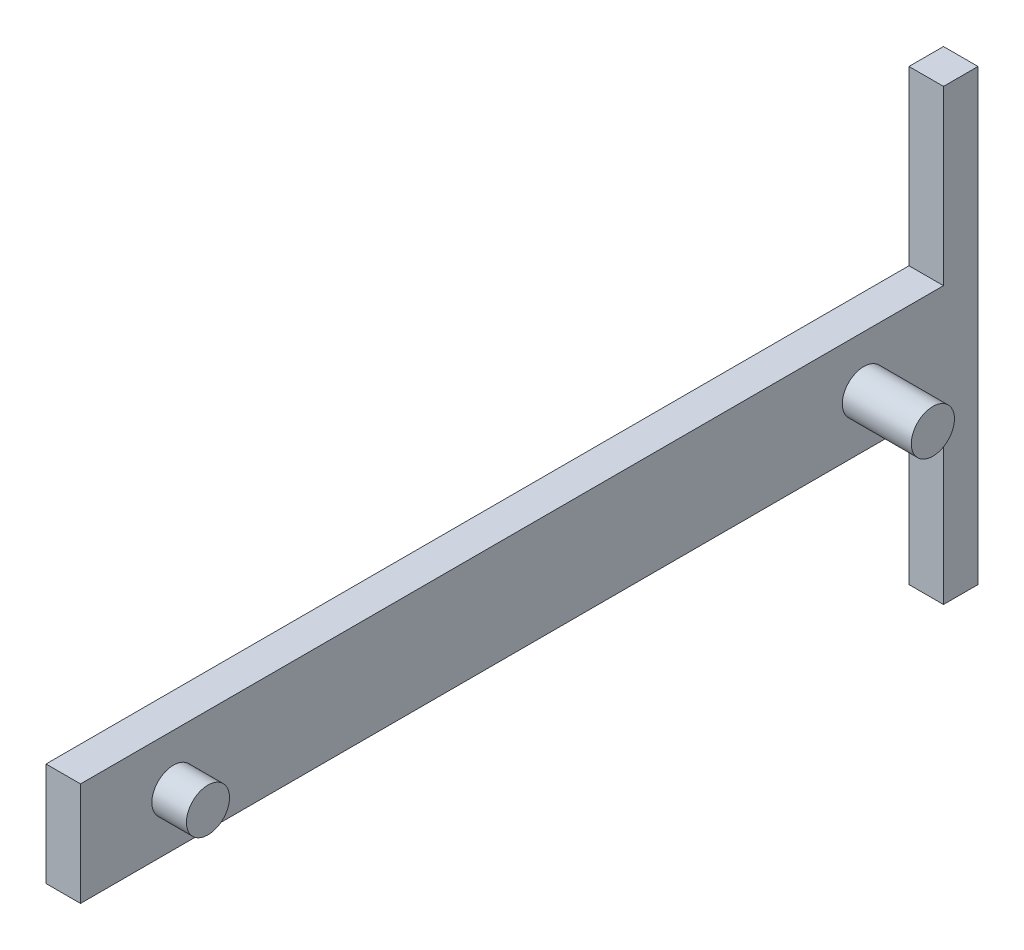
ISO-10303-21;
HEADER;
FILE_DESCRIPTION(('STEP AP214'),'2;1');
FILE_NAME('part.step','',(''),(''),'','','');
FILE_SCHEMA(('AUTOMOTIVE_DESIGN { 1 0 10303 214 1 1 1 1 }'));
ENDSEC;
DATA;
#1=APPLICATION_CONTEXT('core data for automotive mechanical design processes');
#2=APPLICATION_PROTOCOL_DEFINITION('international standard','automotive_design',2000,#1);
#3=PRODUCT_CONTEXT('',#1,'mechanical');
#4=PRODUCT('Part','Part','',(#3));
#5=PRODUCT_RELATED_PRODUCT_CATEGORY('part','',(#4));
#6=PRODUCT_DEFINITION_FORMATION('','',#4);
#7=PRODUCT_DEFINITION_CONTEXT('part definition',#1,'design');
#8=PRODUCT_DEFINITION('design','',#6,#7);
#9=PRODUCT_DEFINITION_SHAPE('','',#8);
#10=(LENGTH_UNIT() NAMED_UNIT(*) SI_UNIT(.MILLI.,.METRE.));
#11=(NAMED_UNIT(*) PLANE_ANGLE_UNIT() SI_UNIT($,.RADIAN.));
#12=(NAMED_UNIT(*) SI_UNIT($,.STERADIAN.) SOLID_ANGLE_UNIT());
#13=UNCERTAINTY_MEASURE_WITH_UNIT(LENGTH_MEASURE(1.E-05),#10,'distance_accuracy_value','');
#14=(GEOMETRIC_REPRESENTATION_CONTEXT(3) GLOBAL_UNCERTAINTY_ASSIGNED_CONTEXT((#13)) GLOBAL_UNIT_ASSIGNED_CONTEXT((#10,
#11,#12)) REPRESENTATION_CONTEXT('',''));
#15=CARTESIAN_POINT('',(0.,0.,0.));
#16=DIRECTION('',(0.,0.,1.));
#17=DIRECTION('',(1.,0.,0.));
#18=AXIS2_PLACEMENT_3D('',#15,#16,#17);
#19=CARTESIAN_POINT('',(1.42700181617041,0.,-400.942278322989));
#20=DIRECTION('',(-1.,0.,0.));
#21=DIRECTION('',(0.,0.,1.));
#22=AXIS2_PLACEMENT_3D('',#19,#20,#21);
#23=CYLINDRICAL_SURFACE('',#22,3.75);
#24=CARTESIAN_POINT('',(-9.1795999016278,0.,-400.942278322989));
#25=DIRECTION('',(1.,0.,0.));
#26=DIRECTION('',(0.,0.,-1.));
#27=AXIS2_PLACEMENT_3D('',#24,#25,#26);
#28=CIRCLE('',#27,3.75);
#29=CARTESIAN_POINT('',(-9.1795999016278,0.,-404.692278322989));
#30=VERTEX_POINT('',#29);
#31=EDGE_CURVE('E45',#30,#30,#28,.F.);
#32=ORIENTED_EDGE('',*,*,#31,.T.);
#33=EDGE_LOOP('',(#32));
#34=FACE_BOUND('',#33,.T.);
#35=CARTESIAN_POINT('',(-15.1795999016278,0.,-400.942278322989));
#36=DIRECTION('',(1.,0.,0.));
#37=DIRECTION('',(0.,0.,-1.));
#38=AXIS2_PLACEMENT_3D('',#35,#36,#37);
#39=CIRCLE('',#38,3.75);
#40=CARTESIAN_POINT('',(-15.1795999016278,0.,-404.692278322989));
#41=VERTEX_POINT('',#40);
#42=EDGE_CURVE('E140',#41,#41,#39,.T.);
#43=ORIENTED_EDGE('',*,*,#42,.T.);
#44=EDGE_LOOP('',(#43));
#45=FACE_BOUND('',#44,.T.);
#46=ADVANCED_FACE('F36',(#34,#45),#23,.T.);
#47=CARTESIAN_POINT('',(-9.1795999016278,0.,-400.942278322989));
#48=DIRECTION('',(1.,0.,0.));
#49=DIRECTION('',(0.,0.,-1.));
#50=AXIS2_PLACEMENT_3D('',#47,#48,#49);
#51=PLANE('',#50);
#52=ORIENTED_EDGE('',*,*,#31,.F.);
#53=EDGE_LOOP('',(#52));
#54=FACE_BOUND('',#53,.T.);
#55=ADVANCED_FACE('F38',(#54),#51,.T.);
#56=CARTESIAN_POINT('',(-21.1795999016278,-9.,-384.787278322989));
#57=DIRECTION('',(0.,0.,1.));
#58=DIRECTION('',(1.,0.,0.));
#59=AXIS2_PLACEMENT_3D('',#56,#57,#58);
#60=PLANE('',#59);
#61=DIRECTION('',(0.,-1.,0.));
#62=VECTOR('',#61,1.);
#63=CARTESIAN_POINT('',(-15.1795999016278,-9.,-384.787278322989));
#64=LINE('',#63,#62);
#65=CARTESIAN_POINT('',(-15.1795999016278,9.,-384.787278322989));
#66=VERTEX_POINT('',#65);
#67=CARTESIAN_POINT('',(-15.1795999016278,-9.,-384.787278322989));
#68=VERTEX_POINT('',#67);
#69=EDGE_CURVE('E136',#66,#68,#64,.T.);
#70=ORIENTED_EDGE('',*,*,#69,.F.);
#71=DIRECTION('',(1.,0.,0.));
#72=VECTOR('',#71,1.);
#73=CARTESIAN_POINT('',(-21.1795999016278,9.,-384.787278322989));
#74=LINE('',#73,#72);
#75=CARTESIAN_POINT('',(-21.1795999016278,9.,-384.787278322989));
#76=VERTEX_POINT('',#75);
#77=EDGE_CURVE('E53',#76,#66,#74,.T.);
#78=ORIENTED_EDGE('',*,*,#77,.F.);
#79=DIRECTION('',(0.,-1.,0.));
#80=VECTOR('',#79,1.);
#81=CARTESIAN_POINT('',(-21.1795999016278,-9.,-384.787278322989));
#82=LINE('',#81,#80);
#83=CARTESIAN_POINT('',(-21.1795999016278,-9.,-384.787278322989));
#84=VERTEX_POINT('',#83);
#85=EDGE_CURVE('E158',#76,#84,#82,.T.);
#86=ORIENTED_EDGE('',*,*,#85,.T.);
#87=DIRECTION('',(1.,0.,0.));
#88=VECTOR('',#87,1.);
#89=CARTESIAN_POINT('',(-21.1795999016278,-9.,-384.787278322989));
#90=LINE('',#89,#88);
#91=EDGE_CURVE('E94',#84,#68,#90,.T.);
#92=ORIENTED_EDGE('',*,*,#91,.T.);
#93=EDGE_LOOP('',(#70,#78,#86,#92));
#94=FACE_BOUND('',#93,.T.);
#95=ADVANCED_FACE('F174',(#94),#60,.T.);
#96=CARTESIAN_POINT('',(-21.1795999016278,9.,-384.787278322989));
#97=DIRECTION('',(0.,1.,0.));
#98=DIRECTION('',(0.,0.,1.));
#99=AXIS2_PLACEMENT_3D('',#96,#97,#98);
#100=PLANE('',#99);
#101=DIRECTION('',(0.,0.,1.));
#102=VECTOR('',#101,1.);
#103=CARTESIAN_POINT('',(-15.1795999016278,9.,-384.787278322989));
#104=LINE('',#103,#102);
#105=CARTESIAN_POINT('',(-15.1795999016278,9.,-534.787278322989));
#106=VERTEX_POINT('',#105);
#107=EDGE_CURVE('E155',#106,#66,#104,.T.);
#108=ORIENTED_EDGE('',*,*,#107,.F.);
#109=DIRECTION('',(1.,0.,0.));
#110=VECTOR('',#109,1.);
#111=CARTESIAN_POINT('',(-21.1795999016278,9.,-534.787278322989));
#112=LINE('',#111,#110);
#113=CARTESIAN_POINT('',(-21.1795999016278,9.,-534.787278322989));
#114=VERTEX_POINT('',#113);
#115=EDGE_CURVE('E82',#114,#106,#112,.T.);
#116=ORIENTED_EDGE('',*,*,#115,.F.);
#117=DIRECTION('',(0.,0.,1.));
#118=VECTOR('',#117,1.);
#119=CARTESIAN_POINT('',(-21.1795999016278,9.,-384.787278322989));
#120=LINE('',#119,#118);
#121=EDGE_CURVE('E126',#114,#76,#120,.T.);
#122=ORIENTED_EDGE('',*,*,#121,.T.);
#123=ORIENTED_EDGE('',*,*,#77,.T.);
#124=EDGE_LOOP('',(#108,#116,#122,#123));
#125=FACE_BOUND('',#124,.T.);
#126=ADVANCED_FACE('F180',(#125),#100,.T.);
#127=CARTESIAN_POINT('',(-21.1795999016278,9.,-534.787278322989));
#128=DIRECTION('',(0.,0.,1.));
#129=DIRECTION('',(1.,0.,0.));
#130=AXIS2_PLACEMENT_3D('',#127,#128,#129);
#131=PLANE('',#130);
#132=DIRECTION('',(0.,-1.,0.));
#133=VECTOR('',#132,1.);
#134=CARTESIAN_POINT('',(-15.1795999016278,9.,-534.787278322989));
#135=LINE('',#134,#133);
#136=CARTESIAN_POINT('',(-15.1795999016278,39.,-534.787278322989));
#137=VERTEX_POINT('',#136);
#138=EDGE_CURVE('E113',#137,#106,#135,.T.);
#139=ORIENTED_EDGE('',*,*,#138,.F.);
#140=DIRECTION('',(1.,0.,0.));
#141=VECTOR('',#140,1.);
#142=CARTESIAN_POINT('',(-21.1795999016278,39.,-534.787278322989));
#143=LINE('',#142,#141);
#144=CARTESIAN_POINT('',(-21.1795999016278,39.,-534.787278322989));
#145=VERTEX_POINT('',#144);
#146=EDGE_CURVE('E108',#145,#137,#143,.T.);
#147=ORIENTED_EDGE('',*,*,#146,.F.);
#148=DIRECTION('',(0.,-1.,0.));
#149=VECTOR('',#148,1.);
#150=CARTESIAN_POINT('',(-21.1795999016278,9.,-534.787278322989));
#151=LINE('',#150,#149);
#152=EDGE_CURVE('E111',#145,#114,#151,.T.);
#153=ORIENTED_EDGE('',*,*,#152,.T.);
#154=ORIENTED_EDGE('',*,*,#115,.T.);
#155=EDGE_LOOP('',(#139,#147,#153,#154));
#156=FACE_BOUND('',#155,.T.);
#157=ADVANCED_FACE('F110',(#156),#131,.T.);
#158=CARTESIAN_POINT('',(-21.1795999016278,39.,-534.787278322989));
#159=DIRECTION('',(0.,1.,0.));
#160=DIRECTION('',(0.,0.,1.));
#161=AXIS2_PLACEMENT_3D('',#158,#159,#160);
#162=PLANE('',#161);
#163=DIRECTION('',(0.,0.,1.));
#164=VECTOR('',#163,1.);
#165=CARTESIAN_POINT('',(-15.1795999016278,39.,-534.787278322989));
#166=LINE('',#165,#164);
#167=CARTESIAN_POINT('',(-15.1795999016278,39.,-540.787278322989));
#168=VERTEX_POINT('',#167);
#169=EDGE_CURVE('E152',#168,#137,#166,.T.);
#170=ORIENTED_EDGE('',*,*,#169,.F.);
#171=DIRECTION('',(1.,0.,0.));
#172=VECTOR('',#171,1.);
#173=CARTESIAN_POINT('',(-21.1795999016278,39.,-540.787278322989));
#174=LINE('',#173,#172);
#175=CARTESIAN_POINT('',(-21.1795999016278,39.,-540.787278322989));
#176=VERTEX_POINT('',#175);
#177=EDGE_CURVE('E118',#176,#168,#174,.T.);
#178=ORIENTED_EDGE('',*,*,#177,.F.);
#179=DIRECTION('',(0.,0.,1.));
#180=VECTOR('',#179,1.);
#181=CARTESIAN_POINT('',(-21.1795999016278,39.,-534.787278322989));
#182=LINE('',#181,#180);
#183=EDGE_CURVE('E124',#176,#145,#182,.T.);
#184=ORIENTED_EDGE('',*,*,#183,.T.);
#185=ORIENTED_EDGE('',*,*,#146,.T.);
#186=EDGE_LOOP('',(#170,#178,#184,#185));
#187=FACE_BOUND('',#186,.T.);
#188=ADVANCED_FACE('F128',(#187),#162,.T.);
#189=CARTESIAN_POINT('',(-21.1795999016278,39.,-540.787278322989));
#190=DIRECTION('',(0.,0.,-1.));
#191=DIRECTION('',(-1.,0.,0.));
#192=AXIS2_PLACEMENT_3D('',#189,#190,#191);
#193=PLANE('',#192);
#194=DIRECTION('',(0.,1.,0.));
#195=VECTOR('',#194,1.);
#196=CARTESIAN_POINT('',(-15.1795999016278,39.,-540.787278322989));
#197=LINE('',#196,#195);
#198=CARTESIAN_POINT('',(-15.1795999016278,-39.,-540.787278322989));
#199=VERTEX_POINT('',#198);
#200=EDGE_CURVE('E149',#199,#168,#197,.T.);
#201=ORIENTED_EDGE('',*,*,#200,.F.);
#202=DIRECTION('',(1.,0.,0.));
#203=VECTOR('',#202,1.);
#204=CARTESIAN_POINT('',(-21.1795999016278,-39.,-540.787278322989));
#205=LINE('',#204,#203);
#206=CARTESIAN_POINT('',(-21.1795999016278,-39.,-540.787278322989));
#207=VERTEX_POINT('',#206);
#208=EDGE_CURVE('E162',#207,#199,#205,.T.);
#209=ORIENTED_EDGE('',*,*,#208,.F.);
#210=DIRECTION('',(0.,1.,0.));
#211=VECTOR('',#210,1.);
#212=CARTESIAN_POINT('',(-21.1795999016278,39.,-540.787278322989));
#213=LINE('',#212,#211);
#214=EDGE_CURVE('E129',#207,#176,#213,.T.);
#215=ORIENTED_EDGE('',*,*,#214,.T.);
#216=ORIENTED_EDGE('',*,*,#177,.T.);
#217=EDGE_LOOP('',(#201,#209,#215,#216));
#218=FACE_BOUND('',#217,.T.);
#219=ADVANCED_FACE('F200',(#218),#193,.T.);
#220=CARTESIAN_POINT('',(-21.1795999016278,-39.,-540.787278322989));
#221=DIRECTION('',(0.,-1.,0.));
#222=DIRECTION('',(0.,0.,-1.));
#223=AXIS2_PLACEMENT_3D('',#220,#221,#222);
#224=PLANE('',#223);
#225=DIRECTION('',(0.,0.,-1.));
#226=VECTOR('',#225,1.);
#227=CARTESIAN_POINT('',(-15.1795999016278,-39.,-540.787278322989));
#228=LINE('',#227,#226);
#229=CARTESIAN_POINT('',(-15.1795999016278,-39.,-534.787278322989));
#230=VERTEX_POINT('',#229);
#231=EDGE_CURVE('E146',#230,#199,#228,.T.);
#232=ORIENTED_EDGE('',*,*,#231,.F.);
#233=DIRECTION('',(1.,0.,0.));
#234=VECTOR('',#233,1.);
#235=CARTESIAN_POINT('',(-21.1795999016278,-39.,-534.787278322989));
#236=LINE('',#235,#234);
#237=CARTESIAN_POINT('',(-21.1795999016278,-39.,-534.787278322989));
#238=VERTEX_POINT('',#237);
#239=EDGE_CURVE('E164',#238,#230,#236,.T.);
#240=ORIENTED_EDGE('',*,*,#239,.F.);
#241=DIRECTION('',(0.,0.,-1.));
#242=VECTOR('',#241,1.);
#243=CARTESIAN_POINT('',(-21.1795999016278,-39.,-540.787278322989));
#244=LINE('',#243,#242);
#245=EDGE_CURVE('E131',#238,#207,#244,.T.);
#246=ORIENTED_EDGE('',*,*,#245,.T.);
#247=ORIENTED_EDGE('',*,*,#208,.T.);
#248=EDGE_LOOP('',(#232,#240,#246,#247));
#249=FACE_BOUND('',#248,.T.);
#250=ADVANCED_FACE('F196',(#249),#224,.T.);
#251=CARTESIAN_POINT('',(-21.1795999016278,-39.,-534.787278322989));
#252=DIRECTION('',(0.,0.,1.));
#253=DIRECTION('',(1.,0.,0.));
#254=AXIS2_PLACEMENT_3D('',#251,#252,#253);
#255=PLANE('',#254);
#256=DIRECTION('',(0.,-1.,0.));
#257=VECTOR('',#256,1.);
#258=CARTESIAN_POINT('',(-15.1795999016278,-39.,-534.787278322989));
#259=LINE('',#258,#257);
#260=CARTESIAN_POINT('',(-15.1795999016278,-9.,-534.787278322989));
#261=VERTEX_POINT('',#260);
#262=EDGE_CURVE('E143',#261,#230,#259,.T.);
#263=ORIENTED_EDGE('',*,*,#262,.F.);
#264=DIRECTION('',(1.,0.,0.));
#265=VECTOR('',#264,1.);
#266=CARTESIAN_POINT('',(-21.1795999016278,-9.,-534.787278322989));
#267=LINE('',#266,#265);
#268=CARTESIAN_POINT('',(-21.1795999016278,-9.,-534.787278322989));
#269=VERTEX_POINT('',#268);
#270=EDGE_CURVE('E166',#269,#261,#267,.T.);
#271=ORIENTED_EDGE('',*,*,#270,.F.);
#272=DIRECTION('',(0.,-1.,0.));
#273=VECTOR('',#272,1.);
#274=CARTESIAN_POINT('',(-21.1795999016278,-39.,-534.787278322989));
#275=LINE('',#274,#273);
#276=EDGE_CURVE('E235',#269,#238,#275,.T.);
#277=ORIENTED_EDGE('',*,*,#276,.T.);
#278=ORIENTED_EDGE('',*,*,#239,.T.);
#279=EDGE_LOOP('',(#263,#271,#277,#278));
#280=FACE_BOUND('',#279,.T.);
#281=ADVANCED_FACE('F193',(#280),#255,.T.);
#282=CARTESIAN_POINT('',(-21.1795999016278,-9.,-534.787278322989));
#283=DIRECTION('',(0.,-1.,0.));
#284=DIRECTION('',(0.,0.,-1.));
#285=AXIS2_PLACEMENT_3D('',#282,#283,#284);
#286=PLANE('',#285);
#287=DIRECTION('',(0.,0.,-1.));
#288=VECTOR('',#287,1.);
#289=CARTESIAN_POINT('',(-15.1795999016278,-9.,-534.787278322989));
#290=LINE('',#289,#288);
#291=EDGE_CURVE('E139',#68,#261,#290,.T.);
#292=ORIENTED_EDGE('',*,*,#291,.F.);
#293=ORIENTED_EDGE('',*,*,#91,.F.);
#294=DIRECTION('',(0.,0.,-1.));
#295=VECTOR('',#294,1.);
#296=CARTESIAN_POINT('',(-21.1795999016278,-9.,-534.787278322989));
#297=LINE('',#296,#295);
#298=EDGE_CURVE('E233',#84,#269,#297,.T.);
#299=ORIENTED_EDGE('',*,*,#298,.T.);
#300=ORIENTED_EDGE('',*,*,#270,.T.);
#301=EDGE_LOOP('',(#292,#293,#299,#300));
#302=FACE_BOUND('',#301,.T.);
#303=ADVANCED_FACE('F190',(#302),#286,.T.);
#304=CARTESIAN_POINT('',(-15.1795999016278,0.,-400.942278322989));
#305=DIRECTION('',(-1.,0.,0.));
#306=DIRECTION('',(0.,0.,1.));
#307=AXIS2_PLACEMENT_3D('',#304,#305,#306);
#308=PLANE('',#307);
#309=CARTESIAN_POINT('',(-15.1795999016278,0.,-520.942278322989));
#310=DIRECTION('',(-1.,0.,0.));
#311=DIRECTION('',(0.,0.,1.));
#312=AXIS2_PLACEMENT_3D('',#309,#310,#311);
#313=CIRCLE('',#312,3.75);
#314=CARTESIAN_POINT('',(-15.1795999016278,0.,-517.192278322989));
#315=VERTEX_POINT('',#314);
#316=EDGE_CURVE('E11',#315,#315,#313,.F.);
#317=ORIENTED_EDGE('',*,*,#316,.F.);
#318=EDGE_LOOP('',(#317));
#319=FACE_BOUND('',#318,.T.);
#320=ORIENTED_EDGE('',*,*,#42,.F.);
#321=EDGE_LOOP('',(#320));
#322=FACE_BOUND('',#321,.T.);
#323=ORIENTED_EDGE('',*,*,#69,.T.);
#324=ORIENTED_EDGE('',*,*,#291,.T.);
#325=ORIENTED_EDGE('',*,*,#262,.T.);
#326=ORIENTED_EDGE('',*,*,#231,.T.);
#327=ORIENTED_EDGE('',*,*,#200,.T.);
#328=ORIENTED_EDGE('',*,*,#169,.T.);
#329=ORIENTED_EDGE('',*,*,#138,.T.);
#330=ORIENTED_EDGE('',*,*,#107,.T.);
#331=EDGE_LOOP('',(#323,#324,#325,#326,#327,#328,#329,#330));
#332=FACE_BOUND('',#331,.T.);
#333=ADVANCED_FACE('F188',(#319,#322,#332),#308,.F.);
#334=CARTESIAN_POINT('',(-21.1795999016278,0.,-400.942278322989));
#335=DIRECTION('',(-1.,0.,0.));
#336=DIRECTION('',(0.,0.,1.));
#337=AXIS2_PLACEMENT_3D('',#334,#335,#336);
#338=PLANE('',#337);
#339=ORIENTED_EDGE('',*,*,#85,.F.);
#340=ORIENTED_EDGE('',*,*,#121,.F.);
#341=ORIENTED_EDGE('',*,*,#152,.F.);
#342=ORIENTED_EDGE('',*,*,#183,.F.);
#343=ORIENTED_EDGE('',*,*,#214,.F.);
#344=ORIENTED_EDGE('',*,*,#245,.F.);
#345=ORIENTED_EDGE('',*,*,#276,.F.);
#346=ORIENTED_EDGE('',*,*,#298,.F.);
#347=EDGE_LOOP('',(#339,#340,#341,#342,#343,#344,#345,#346));
#348=FACE_BOUND('',#347,.T.);
#349=ADVANCED_FACE('F122',(#348),#338,.T.);
#350=CARTESIAN_POINT('',(7.42700181617042,0.,-520.942278322989));
#351=DIRECTION('',(-1.,0.,0.));
#352=DIRECTION('',(0.,0.,1.));
#353=AXIS2_PLACEMENT_3D('',#350,#351,#352);
#354=CYLINDRICAL_SURFACE('',#353,3.75);
#355=ORIENTED_EDGE('',*,*,#316,.T.);
#356=EDGE_LOOP('',(#355));
#357=FACE_BOUND('',#356,.T.);
#358=CARTESIAN_POINT('',(-3.1795999016278,0.,-520.942278322989));
#359=DIRECTION('',(1.,0.,0.));
#360=DIRECTION('',(0.,0.,-1.));
#361=AXIS2_PLACEMENT_3D('',#358,#359,#360);
#362=CIRCLE('',#361,3.75);
#363=CARTESIAN_POINT('',(-3.1795999016278,0.,-524.692278322989));
#364=VERTEX_POINT('',#363);
#365=EDGE_CURVE('E227',#364,#364,#362,.T.);
#366=ORIENTED_EDGE('',*,*,#365,.F.);
#367=EDGE_LOOP('',(#366));
#368=FACE_BOUND('',#367,.T.);
#369=ADVANCED_FACE('F187',(#357,#368),#354,.T.);
#370=CARTESIAN_POINT('',(-3.1795999016278,0.,-400.942278322989));
#371=DIRECTION('',(1.,0.,0.));
#372=DIRECTION('',(0.,0.,-1.));
#373=AXIS2_PLACEMENT_3D('',#370,#371,#372);
#374=PLANE('',#373);
#375=ORIENTED_EDGE('',*,*,#365,.T.);
#376=EDGE_LOOP('',(#375));
#377=FACE_BOUND('',#376,.T.);
#378=ADVANCED_FACE('F214',(#377),#374,.T.);
#379=CLOSED_SHELL('',(#46,#55,#95,#126,#157,#188,#219,#250,#281,#303,#333,#349,#369,#378));
#380=MANIFOLD_SOLID_BREP('B2',#379);
#381=ADVANCED_BREP_SHAPE_REPRESENTATION('',(#18,#380),#14);
#382=SHAPE_DEFINITION_REPRESENTATION(#9,#381);
ENDSEC;
END-ISO-10303-21;
